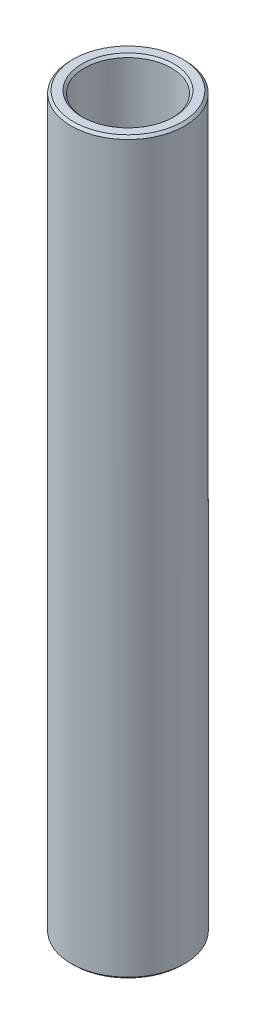
ISO-10303-21;
HEADER;
FILE_DESCRIPTION(('STEP AP214'),'2;1');
FILE_NAME('part.step','',(''),(''),'','','');
FILE_SCHEMA(('AUTOMOTIVE_DESIGN { 1 0 10303 214 1 1 1 1 }'));
ENDSEC;
DATA;
#1=APPLICATION_CONTEXT('core data for automotive mechanical design processes');
#2=APPLICATION_PROTOCOL_DEFINITION('international standard','automotive_design',2000,#1);
#3=PRODUCT_CONTEXT('',#1,'mechanical');
#4=PRODUCT('Part','Part','',(#3));
#5=PRODUCT_RELATED_PRODUCT_CATEGORY('part','',(#4));
#6=PRODUCT_DEFINITION_FORMATION('','',#4);
#7=PRODUCT_DEFINITION_CONTEXT('part definition',#1,'design');
#8=PRODUCT_DEFINITION('design','',#6,#7);
#9=PRODUCT_DEFINITION_SHAPE('','',#8);
#10=(LENGTH_UNIT() NAMED_UNIT(*) SI_UNIT(.MILLI.,.METRE.));
#11=(NAMED_UNIT(*) PLANE_ANGLE_UNIT() SI_UNIT($,.RADIAN.));
#12=(NAMED_UNIT(*) SI_UNIT($,.STERADIAN.) SOLID_ANGLE_UNIT());
#13=UNCERTAINTY_MEASURE_WITH_UNIT(LENGTH_MEASURE(1.E-05),#10,'distance_accuracy_value','');
#14=(GEOMETRIC_REPRESENTATION_CONTEXT(3) GLOBAL_UNCERTAINTY_ASSIGNED_CONTEXT((#13)) GLOBAL_UNIT_ASSIGNED_CONTEXT((#10,
#11,#12)) REPRESENTATION_CONTEXT('',''));
#15=CARTESIAN_POINT('',(0.,0.,0.));
#16=DIRECTION('',(0.,0.,1.));
#17=DIRECTION('',(1.,0.,0.));
#18=AXIS2_PLACEMENT_3D('',#15,#16,#17);
#19=CARTESIAN_POINT('',(3.,19.275,0.));
#20=DIRECTION('',(0.,-1.,0.));
#21=DIRECTION('',(0.,0.,-1.));
#22=AXIS2_PLACEMENT_3D('',#19,#20,#21);
#23=PLANE('',#22);
#24=CARTESIAN_POINT('',(0.,19.275,0.));
#25=DIRECTION('',(0.,-1.,0.));
#26=DIRECTION('',(0.,0.,-1.));
#27=AXIS2_PLACEMENT_3D('',#24,#25,#26);
#28=CIRCLE('',#27,2.87300000000001);
#29=CARTESIAN_POINT('',(0.,19.275,-2.87300000000001));
#30=VERTEX_POINT('',#29);
#31=EDGE_CURVE('E10',#30,#30,#28,.F.);
#32=ORIENTED_EDGE('',*,*,#31,.T.);
#33=EDGE_LOOP('',(#32));
#34=FACE_BOUND('',#33,.T.);
#35=CARTESIAN_POINT('',(0.,19.275,0.));
#36=DIRECTION('',(0.,-1.,0.));
#37=DIRECTION('',(0.,0.,-1.));
#38=AXIS2_PLACEMENT_3D('',#35,#36,#37);
#39=CIRCLE('',#38,2.427);
#40=CARTESIAN_POINT('',(0.,19.275,-2.427));
#41=VERTEX_POINT('',#40);
#42=EDGE_CURVE('E37',#41,#41,#39,.T.);
#43=ORIENTED_EDGE('',*,*,#42,.T.);
#44=EDGE_LOOP('',(#43));
#45=FACE_BOUND('',#44,.T.);
#46=ADVANCED_FACE('F30',(#34,#45),#23,.F.);
#47=CARTESIAN_POINT('',(0.,12.831952247191,0.));
#48=DIRECTION('',(0.,1.,0.));
#49=DIRECTION('',(0.,0.,1.));
#50=AXIS2_PLACEMENT_3D('',#47,#48,#49);
#51=CYLINDRICAL_SURFACE('',#50,2.3);
#52=CARTESIAN_POINT('',(0.,-19.148,0.));
#53=DIRECTION('',(0.,1.,0.));
#54=DIRECTION('',(0.,0.,1.));
#55=AXIS2_PLACEMENT_3D('',#52,#53,#54);
#56=CIRCLE('',#55,2.3);
#57=CARTESIAN_POINT('',(0.,-19.148,2.3));
#58=VERTEX_POINT('',#57);
#59=EDGE_CURVE('E50',#58,#58,#56,.F.);
#60=ORIENTED_EDGE('',*,*,#59,.T.);
#61=EDGE_LOOP('',(#60));
#62=FACE_BOUND('',#61,.T.);
#63=CARTESIAN_POINT('',(0.,19.148,0.));
#64=DIRECTION('',(0.,-1.,0.));
#65=DIRECTION('',(0.,0.,-1.));
#66=AXIS2_PLACEMENT_3D('',#63,#64,#65);
#67=CIRCLE('',#66,2.3);
#68=CARTESIAN_POINT('',(0.,19.148,-2.3));
#69=VERTEX_POINT('',#68);
#70=EDGE_CURVE('E53',#69,#69,#67,.F.);
#71=ORIENTED_EDGE('',*,*,#70,.T.);
#72=EDGE_LOOP('',(#71));
#73=FACE_BOUND('',#72,.T.);
#74=ADVANCED_FACE('F86',(#62,#73),#51,.F.);
#75=CARTESIAN_POINT('',(2.3,-19.275,0.));
#76=DIRECTION('',(0.,1.,0.));
#77=DIRECTION('',(0.,0.,1.));
#78=AXIS2_PLACEMENT_3D('',#75,#76,#77);
#79=PLANE('',#78);
#80=CARTESIAN_POINT('',(0.,-19.275,0.));
#81=DIRECTION('',(0.,1.,0.));
#82=DIRECTION('',(0.,0.,1.));
#83=AXIS2_PLACEMENT_3D('',#80,#81,#82);
#84=CIRCLE('',#83,2.427);
#85=CARTESIAN_POINT('',(0.,-19.275,2.427));
#86=VERTEX_POINT('',#85);
#87=EDGE_CURVE('E56',#86,#86,#84,.T.);
#88=ORIENTED_EDGE('',*,*,#87,.T.);
#89=EDGE_LOOP('',(#88));
#90=FACE_BOUND('',#89,.T.);
#91=CARTESIAN_POINT('',(0.,-19.275,0.));
#92=DIRECTION('',(0.,1.,0.));
#93=DIRECTION('',(0.,0.,1.));
#94=AXIS2_PLACEMENT_3D('',#91,#92,#93);
#95=CIRCLE('',#94,2.87299999999999);
#96=CARTESIAN_POINT('',(0.,-19.275,2.87299999999999));
#97=VERTEX_POINT('',#96);
#98=EDGE_CURVE('E59',#97,#97,#95,.F.);
#99=ORIENTED_EDGE('',*,*,#98,.T.);
#100=EDGE_LOOP('',(#99));
#101=FACE_BOUND('',#100,.T.);
#102=ADVANCED_FACE('F63',(#90,#101),#79,.F.);
#103=CARTESIAN_POINT('',(0.,12.831952247191,0.));
#104=DIRECTION('',(0.,1.,0.));
#105=DIRECTION('',(0.,0.,1.));
#106=AXIS2_PLACEMENT_3D('',#103,#104,#105);
#107=CYLINDRICAL_SURFACE('',#106,3.);
#108=CARTESIAN_POINT('',(0.,-19.148,0.));
#109=DIRECTION('',(0.,1.,0.));
#110=DIRECTION('',(0.,0.,1.));
#111=AXIS2_PLACEMENT_3D('',#108,#109,#110);
#112=CIRCLE('',#111,3.);
#113=CARTESIAN_POINT('',(0.,-19.148,3.));
#114=VERTEX_POINT('',#113);
#115=EDGE_CURVE('E41',#114,#114,#112,.T.);
#116=ORIENTED_EDGE('',*,*,#115,.T.);
#117=EDGE_LOOP('',(#116));
#118=FACE_BOUND('',#117,.T.);
#119=CARTESIAN_POINT('',(0.,19.148,0.));
#120=DIRECTION('',(0.,-1.,0.));
#121=DIRECTION('',(0.,0.,-1.));
#122=AXIS2_PLACEMENT_3D('',#119,#120,#121);
#123=CIRCLE('',#122,3.);
#124=CARTESIAN_POINT('',(0.,19.148,-3.));
#125=VERTEX_POINT('',#124);
#126=EDGE_CURVE('E45',#125,#125,#123,.T.);
#127=ORIENTED_EDGE('',*,*,#126,.T.);
#128=EDGE_LOOP('',(#127));
#129=FACE_BOUND('',#128,.T.);
#130=ADVANCED_FACE('F73',(#118,#129),#107,.T.);
#131=CARTESIAN_POINT('',(0.,-19.275,0.));
#132=DIRECTION('',(0.,-1.,0.));
#133=DIRECTION('',(0.,0.,-1.));
#134=AXIS2_PLACEMENT_3D('',#131,#132,#133);
#135=CONICAL_SURFACE('',#134,2.427,0.785398163397436);
#136=ORIENTED_EDGE('',*,*,#59,.F.);
#137=EDGE_LOOP('',(#136));
#138=FACE_BOUND('',#137,.T.);
#139=ORIENTED_EDGE('',*,*,#87,.F.);
#140=EDGE_LOOP('',(#139));
#141=FACE_BOUND('',#140,.T.);
#142=ADVANCED_FACE('F69',(#138,#141),#135,.F.);
#143=CARTESIAN_POINT('',(0.,-19.148,0.));
#144=DIRECTION('',(0.,1.,0.));
#145=DIRECTION('',(0.,0.,1.));
#146=AXIS2_PLACEMENT_3D('',#143,#144,#145);
#147=CONICAL_SURFACE('',#146,3.,0.785398163397418);
#148=ORIENTED_EDGE('',*,*,#98,.F.);
#149=EDGE_LOOP('',(#148));
#150=FACE_BOUND('',#149,.T.);
#151=ORIENTED_EDGE('',*,*,#115,.F.);
#152=EDGE_LOOP('',(#151));
#153=FACE_BOUND('',#152,.T.);
#154=ADVANCED_FACE('F65',(#150,#153),#147,.T.);
#155=CARTESIAN_POINT('',(0.,19.275,0.));
#156=DIRECTION('',(0.,-1.,0.));
#157=DIRECTION('',(0.,0.,-1.));
#158=AXIS2_PLACEMENT_3D('',#155,#156,#157);
#159=CONICAL_SURFACE('',#158,2.87300000000001,0.785398163397445);
#160=ORIENTED_EDGE('',*,*,#126,.F.);
#161=EDGE_LOOP('',(#160));
#162=FACE_BOUND('',#161,.T.);
#163=ORIENTED_EDGE('',*,*,#31,.F.);
#164=EDGE_LOOP('',(#163));
#165=FACE_BOUND('',#164,.T.);
#166=ADVANCED_FACE('F68',(#162,#165),#159,.T.);
#167=CARTESIAN_POINT('',(0.,19.148,0.));
#168=DIRECTION('',(0.,1.,0.));
#169=DIRECTION('',(0.,0.,1.));
#170=AXIS2_PLACEMENT_3D('',#167,#168,#169);
#171=CONICAL_SURFACE('',#170,2.3,0.785398163397436);
#172=ORIENTED_EDGE('',*,*,#42,.F.);
#173=EDGE_LOOP('',(#172));
#174=FACE_BOUND('',#173,.T.);
#175=ORIENTED_EDGE('',*,*,#70,.F.);
#176=EDGE_LOOP('',(#175));
#177=FACE_BOUND('',#176,.T.);
#178=ADVANCED_FACE('F32',(#174,#177),#171,.F.);
#179=CLOSED_SHELL('',(#46,#74,#102,#130,#142,#154,#166,#178));
#180=MANIFOLD_SOLID_BREP('B2',#179);
#181=ADVANCED_BREP_SHAPE_REPRESENTATION('',(#18,#180),#14);
#182=SHAPE_DEFINITION_REPRESENTATION(#9,#181);
ENDSEC;
END-ISO-10303-21;
